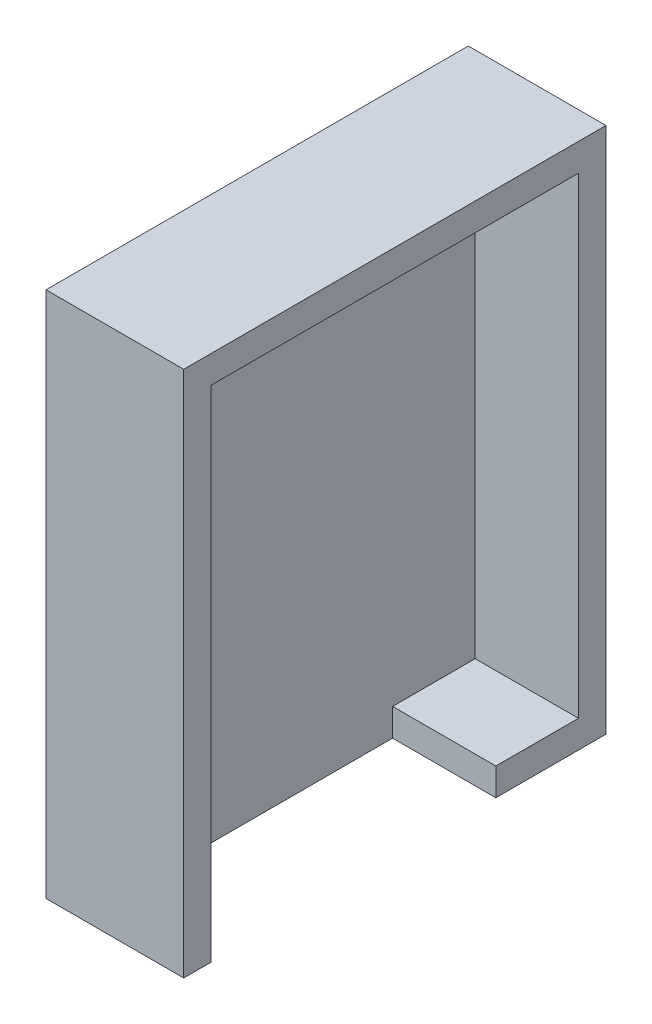
ISO-10303-21;
HEADER;
FILE_DESCRIPTION(('STEP AP214'),'2;1');
FILE_NAME('part.step','',(''),(''),'','','');
FILE_SCHEMA(('AUTOMOTIVE_DESIGN { 1 0 10303 214 1 1 1 1 }'));
ENDSEC;
DATA;
#1=APPLICATION_CONTEXT('core data for automotive mechanical design processes');
#2=APPLICATION_PROTOCOL_DEFINITION('international standard','automotive_design',2000,#1);
#3=PRODUCT_CONTEXT('',#1,'mechanical');
#4=PRODUCT('Part','Part','',(#3));
#5=PRODUCT_RELATED_PRODUCT_CATEGORY('part','',(#4));
#6=PRODUCT_DEFINITION_FORMATION('','',#4);
#7=PRODUCT_DEFINITION_CONTEXT('part definition',#1,'design');
#8=PRODUCT_DEFINITION('design','',#6,#7);
#9=PRODUCT_DEFINITION_SHAPE('','',#8);
#10=(LENGTH_UNIT() NAMED_UNIT(*) SI_UNIT(.MILLI.,.METRE.));
#11=(NAMED_UNIT(*) PLANE_ANGLE_UNIT() SI_UNIT($,.RADIAN.));
#12=(NAMED_UNIT(*) SI_UNIT($,.STERADIAN.) SOLID_ANGLE_UNIT());
#13=UNCERTAINTY_MEASURE_WITH_UNIT(LENGTH_MEASURE(1.E-05),#10,'distance_accuracy_value','');
#14=(GEOMETRIC_REPRESENTATION_CONTEXT(3) GLOBAL_UNCERTAINTY_ASSIGNED_CONTEXT((#13)) GLOBAL_UNIT_ASSIGNED_CONTEXT((#10,
#11,#12)) REPRESENTATION_CONTEXT('',''));
#15=CARTESIAN_POINT('',(0.,0.,0.));
#16=DIRECTION('',(0.,0.,1.));
#17=DIRECTION('',(1.,0.,0.));
#18=AXIS2_PLACEMENT_3D('',#15,#16,#17);
#19=CARTESIAN_POINT('',(15.,0.,-53.34));
#20=DIRECTION('',(0.,0.,1.));
#21=DIRECTION('',(0.,-1.,0.));
#22=AXIS2_PLACEMENT_3D('',#19,#20,#21);
#23=PLANE('',#22);
#24=DIRECTION('',(0.,1.,0.));
#25=VECTOR('',#24,1.);
#26=CARTESIAN_POINT('',(0.,0.,-53.34));
#27=LINE('',#26,#25);
#28=CARTESIAN_POINT('',(0.,-68.58,-53.34));
#29=VERTEX_POINT('',#28);
#30=CARTESIAN_POINT('',(0.,0.,-53.34));
#31=VERTEX_POINT('',#30);
#32=EDGE_CURVE('E164',#29,#31,#27,.T.);
#33=ORIENTED_EDGE('',*,*,#32,.F.);
#34=DIRECTION('',(-1.,0.,0.));
#35=VECTOR('',#34,1.);
#36=CARTESIAN_POINT('',(27.6491106406735,-68.58,-53.34));
#37=LINE('',#36,#35);
#38=CARTESIAN_POINT('',(15.,-68.58,-53.34));
#39=VERTEX_POINT('',#38);
#40=EDGE_CURVE('E48',#39,#29,#37,.T.);
#41=ORIENTED_EDGE('',*,*,#40,.F.);
#42=DIRECTION('',(0.,1.,0.));
#43=VECTOR('',#42,1.);
#44=CARTESIAN_POINT('',(15.,0.,-53.34));
#45=LINE('',#44,#43);
#46=CARTESIAN_POINT('',(15.,0.,-53.34));
#47=VERTEX_POINT('',#46);
#48=EDGE_CURVE('E157',#39,#47,#45,.T.);
#49=ORIENTED_EDGE('',*,*,#48,.T.);
#50=DIRECTION('',(-1.,0.,0.));
#51=VECTOR('',#50,1.);
#52=CARTESIAN_POINT('',(15.,0.,-53.34));
#53=LINE('',#52,#51);
#54=EDGE_CURVE('E169',#47,#31,#53,.T.);
#55=ORIENTED_EDGE('',*,*,#54,.T.);
#56=EDGE_LOOP('',(#33,#41,#49,#55));
#57=FACE_BOUND('',#56,.T.);
#58=ADVANCED_FACE('F33',(#57),#23,.T.);
#59=CARTESIAN_POINT('',(0.,0.,0.));
#60=DIRECTION('',(-1.,0.,0.));
#61=DIRECTION('',(0.,0.,1.));
#62=AXIS2_PLACEMENT_3D('',#59,#60,#61);
#63=PLANE('',#62);
#64=DIRECTION('',(0.,0.,1.));
#65=VECTOR('',#64,1.);
#66=CARTESIAN_POINT('',(0.,-68.58,-41.34));
#67=LINE('',#66,#65);
#68=CARTESIAN_POINT('',(0.,-68.58,-41.34));
#69=VERTEX_POINT('',#68);
#70=EDGE_CURVE('E133',#29,#69,#67,.T.);
#71=ORIENTED_EDGE('',*,*,#70,.F.);
#72=ORIENTED_EDGE('',*,*,#32,.T.);
#73=DIRECTION('',(0.,0.,1.));
#74=VECTOR('',#73,1.);
#75=CARTESIAN_POINT('',(0.,0.,0.));
#76=LINE('',#75,#74);
#77=CARTESIAN_POINT('',(0.,0.,0.));
#78=VERTEX_POINT('',#77);
#79=EDGE_CURVE('E158',#31,#78,#76,.T.);
#80=ORIENTED_EDGE('',*,*,#79,.T.);
#81=DIRECTION('',(0.,-1.,0.));
#82=VECTOR('',#81,1.);
#83=CARTESIAN_POINT('',(0.,0.,0.));
#84=LINE('',#83,#82);
#85=CARTESIAN_POINT('',(0.,-72.58,0.));
#86=VERTEX_POINT('',#85);
#87=EDGE_CURVE('E112',#78,#86,#84,.T.);
#88=ORIENTED_EDGE('',*,*,#87,.T.);
#89=DIRECTION('',(0.,0.,-1.));
#90=VECTOR('',#89,1.);
#91=CARTESIAN_POINT('',(0.,-72.58,0.));
#92=LINE('',#91,#90);
#93=CARTESIAN_POINT('',(0.,-72.58,-41.34));
#94=VERTEX_POINT('',#93);
#95=EDGE_CURVE('E108',#86,#94,#92,.T.);
#96=ORIENTED_EDGE('',*,*,#95,.T.);
#97=DIRECTION('',(0.,-1.,0.));
#98=VECTOR('',#97,1.);
#99=CARTESIAN_POINT('',(0.,-72.58,-41.34));
#100=LINE('',#99,#98);
#101=EDGE_CURVE('E56',#69,#94,#100,.T.);
#102=ORIENTED_EDGE('',*,*,#101,.F.);
#103=EDGE_LOOP('',(#71,#72,#80,#88,#96,#102));
#104=FACE_BOUND('',#103,.T.);
#105=ADVANCED_FACE('F110',(#104),#63,.F.);
#106=CARTESIAN_POINT('',(15.,0.,0.));
#107=DIRECTION('',(-1.,0.,0.));
#108=DIRECTION('',(0.,0.,1.));
#109=AXIS2_PLACEMENT_3D('',#106,#107,#108);
#110=PLANE('',#109);
#111=ORIENTED_EDGE('',*,*,#48,.F.);
#112=DIRECTION('',(0.,0.,-1.));
#113=VECTOR('',#112,1.);
#114=CARTESIAN_POINT('',(15.,-68.58,-41.34));
#115=LINE('',#114,#113);
#116=CARTESIAN_POINT('',(15.,-68.58,-41.34));
#117=VERTEX_POINT('',#116);
#118=EDGE_CURVE('E127',#117,#39,#115,.T.);
#119=ORIENTED_EDGE('',*,*,#118,.F.);
#120=DIRECTION('',(0.,1.,0.));
#121=VECTOR('',#120,1.);
#122=CARTESIAN_POINT('',(15.,-72.58,-41.34));
#123=LINE('',#122,#121);
#124=CARTESIAN_POINT('',(15.,-72.58,-41.34));
#125=VERTEX_POINT('',#124);
#126=EDGE_CURVE('E137',#125,#117,#123,.T.);
#127=ORIENTED_EDGE('',*,*,#126,.F.);
#128=DIRECTION('',(0.,0.,-1.));
#129=VECTOR('',#128,1.);
#130=CARTESIAN_POINT('',(15.,-72.58,4.));
#131=LINE('',#130,#129);
#132=CARTESIAN_POINT('',(15.,-72.58,-57.34));
#133=VERTEX_POINT('',#132);
#134=EDGE_CURVE('E123',#125,#133,#131,.T.);
#135=ORIENTED_EDGE('',*,*,#134,.T.);
#136=DIRECTION('',(0.,1.,0.));
#137=VECTOR('',#136,1.);
#138=CARTESIAN_POINT('',(15.,4.,-57.34));
#139=LINE('',#138,#137);
#140=CARTESIAN_POINT('',(15.,4.,-57.34));
#141=VERTEX_POINT('',#140);
#142=EDGE_CURVE('E180',#133,#141,#139,.T.);
#143=ORIENTED_EDGE('',*,*,#142,.T.);
#144=DIRECTION('',(0.,0.,1.));
#145=VECTOR('',#144,1.);
#146=CARTESIAN_POINT('',(15.,4.,4.));
#147=LINE('',#146,#145);
#148=CARTESIAN_POINT('',(15.,4.,4.));
#149=VERTEX_POINT('',#148);
#150=EDGE_CURVE('E172',#141,#149,#147,.T.);
#151=ORIENTED_EDGE('',*,*,#150,.T.);
#152=DIRECTION('',(0.,-1.,0.));
#153=VECTOR('',#152,1.);
#154=CARTESIAN_POINT('',(15.,4.,4.));
#155=LINE('',#154,#153);
#156=CARTESIAN_POINT('',(15.,-72.58,4.));
#157=VERTEX_POINT('',#156);
#158=EDGE_CURVE('E175',#149,#157,#155,.T.);
#159=ORIENTED_EDGE('',*,*,#158,.T.);
#160=CARTESIAN_POINT('',(15.,-72.58,0.));
#161=VERTEX_POINT('',#160);
#162=EDGE_CURVE('E177',#157,#161,#131,.T.);
#163=ORIENTED_EDGE('',*,*,#162,.T.);
#164=DIRECTION('',(0.,-1.,0.));
#165=VECTOR('',#164,1.);
#166=CARTESIAN_POINT('',(15.,0.,0.));
#167=LINE('',#166,#165);
#168=CARTESIAN_POINT('',(15.,0.,0.));
#169=VERTEX_POINT('',#168);
#170=EDGE_CURVE('E155',#169,#161,#167,.T.);
#171=ORIENTED_EDGE('',*,*,#170,.F.);
#172=DIRECTION('',(0.,0.,1.));
#173=VECTOR('',#172,1.);
#174=CARTESIAN_POINT('',(15.,0.,0.));
#175=LINE('',#174,#173);
#176=EDGE_CURVE('E160',#47,#169,#175,.T.);
#177=ORIENTED_EDGE('',*,*,#176,.F.);
#178=EDGE_LOOP('',(#111,#119,#127,#135,#143,#151,#159,#163,#171,#177));
#179=FACE_BOUND('',#178,.T.);
#180=ADVANCED_FACE('F203',(#179),#110,.F.);
#181=CARTESIAN_POINT('',(15.,4.,4.));
#182=DIRECTION('',(0.,-1.,0.));
#183=DIRECTION('',(0.,0.,-1.));
#184=AXIS2_PLACEMENT_3D('',#181,#182,#183);
#185=PLANE('',#184);
#186=DIRECTION('',(-1.,0.,0.));
#187=VECTOR('',#186,1.);
#188=CARTESIAN_POINT('',(15.,4.,-57.34));
#189=LINE('',#188,#187);
#190=CARTESIAN_POINT('',(-5.,4.,-57.34));
#191=VERTEX_POINT('',#190);
#192=EDGE_CURVE('E182',#141,#191,#189,.T.);
#193=ORIENTED_EDGE('',*,*,#192,.T.);
#194=DIRECTION('',(0.,0.,-1.));
#195=VECTOR('',#194,1.);
#196=CARTESIAN_POINT('',(-5.,4.,-57.34));
#197=LINE('',#196,#195);
#198=CARTESIAN_POINT('',(-5.,4.,4.));
#199=VERTEX_POINT('',#198);
#200=EDGE_CURVE('E152',#199,#191,#197,.T.);
#201=ORIENTED_EDGE('',*,*,#200,.F.);
#202=DIRECTION('',(-1.,0.,0.));
#203=VECTOR('',#202,1.);
#204=CARTESIAN_POINT('',(15.,4.,4.));
#205=LINE('',#204,#203);
#206=EDGE_CURVE('E11',#149,#199,#205,.T.);
#207=ORIENTED_EDGE('',*,*,#206,.F.);
#208=ORIENTED_EDGE('',*,*,#150,.F.);
#209=EDGE_LOOP('',(#193,#201,#207,#208));
#210=FACE_BOUND('',#209,.T.);
#211=ADVANCED_FACE('F35',(#210),#185,.F.);
#212=CARTESIAN_POINT('',(15.,4.,4.));
#213=DIRECTION('',(0.,0.,-1.));
#214=DIRECTION('',(-1.,0.,0.));
#215=AXIS2_PLACEMENT_3D('',#212,#213,#214);
#216=PLANE('',#215);
#217=ORIENTED_EDGE('',*,*,#206,.T.);
#218=DIRECTION('',(0.,1.,0.));
#219=VECTOR('',#218,1.);
#220=CARTESIAN_POINT('',(-5.,4.,4.));
#221=LINE('',#220,#219);
#222=CARTESIAN_POINT('',(-5.,-72.58,4.));
#223=VERTEX_POINT('',#222);
#224=EDGE_CURVE('E149',#223,#199,#221,.T.);
#225=ORIENTED_EDGE('',*,*,#224,.F.);
#226=DIRECTION('',(-1.,0.,0.));
#227=VECTOR('',#226,1.);
#228=CARTESIAN_POINT('',(15.,-72.58,4.));
#229=LINE('',#228,#227);
#230=EDGE_CURVE('E41',#157,#223,#229,.T.);
#231=ORIENTED_EDGE('',*,*,#230,.F.);
#232=ORIENTED_EDGE('',*,*,#158,.F.);
#233=EDGE_LOOP('',(#217,#225,#231,#232));
#234=FACE_BOUND('',#233,.T.);
#235=ADVANCED_FACE('F194',(#234),#216,.F.);
#236=CARTESIAN_POINT('',(15.,-72.58,4.));
#237=DIRECTION('',(0.,1.,0.));
#238=DIRECTION('',(0.,0.,1.));
#239=AXIS2_PLACEMENT_3D('',#236,#237,#238);
#240=PLANE('',#239);
#241=ORIENTED_EDGE('',*,*,#134,.F.);
#242=DIRECTION('',(-1.,0.,0.));
#243=VECTOR('',#242,1.);
#244=CARTESIAN_POINT('',(27.6491106406735,-72.58,-41.34));
#245=LINE('',#244,#243);
#246=EDGE_CURVE('E120',#125,#94,#245,.T.);
#247=ORIENTED_EDGE('',*,*,#246,.T.);
#248=ORIENTED_EDGE('',*,*,#95,.F.);
#249=DIRECTION('',(-1.,0.,0.));
#250=VECTOR('',#249,1.);
#251=CARTESIAN_POINT('',(19.05,-72.58,0.));
#252=LINE('',#251,#250);
#253=EDGE_CURVE('E117',#161,#86,#252,.T.);
#254=ORIENTED_EDGE('',*,*,#253,.F.);
#255=ORIENTED_EDGE('',*,*,#162,.F.);
#256=ORIENTED_EDGE('',*,*,#230,.T.);
#257=DIRECTION('',(0.,0.,1.));
#258=VECTOR('',#257,1.);
#259=CARTESIAN_POINT('',(-5.,-72.58,-57.34));
#260=LINE('',#259,#258);
#261=CARTESIAN_POINT('',(-5.,-72.58,-57.34));
#262=VERTEX_POINT('',#261);
#263=EDGE_CURVE('E146',#262,#223,#260,.T.);
#264=ORIENTED_EDGE('',*,*,#263,.F.);
#265=DIRECTION('',(-1.,0.,0.));
#266=VECTOR('',#265,1.);
#267=CARTESIAN_POINT('',(15.,-72.58,-57.34));
#268=LINE('',#267,#266);
#269=EDGE_CURVE('E184',#133,#262,#268,.T.);
#270=ORIENTED_EDGE('',*,*,#269,.F.);
#271=EDGE_LOOP('',(#241,#247,#248,#254,#255,#256,#264,#270));
#272=FACE_BOUND('',#271,.T.);
#273=ADVANCED_FACE('F121',(#272),#240,.F.);
#274=CARTESIAN_POINT('',(15.,4.,-57.34));
#275=DIRECTION('',(0.,0.,1.));
#276=DIRECTION('',(0.,-1.,0.));
#277=AXIS2_PLACEMENT_3D('',#274,#275,#276);
#278=PLANE('',#277);
#279=ORIENTED_EDGE('',*,*,#269,.T.);
#280=DIRECTION('',(0.,-1.,0.));
#281=VECTOR('',#280,1.);
#282=CARTESIAN_POINT('',(-5.,4.,-57.34));
#283=LINE('',#282,#281);
#284=EDGE_CURVE('E116',#191,#262,#283,.T.);
#285=ORIENTED_EDGE('',*,*,#284,.F.);
#286=ORIENTED_EDGE('',*,*,#192,.F.);
#287=ORIENTED_EDGE('',*,*,#142,.F.);
#288=EDGE_LOOP('',(#279,#285,#286,#287));
#289=FACE_BOUND('',#288,.T.);
#290=ADVANCED_FACE('F200',(#289),#278,.F.);
#291=CARTESIAN_POINT('',(15.,0.,0.));
#292=DIRECTION('',(0.,0.,-1.));
#293=DIRECTION('',(0.,1.,0.));
#294=AXIS2_PLACEMENT_3D('',#291,#292,#293);
#295=PLANE('',#294);
#296=ORIENTED_EDGE('',*,*,#170,.T.);
#297=ORIENTED_EDGE('',*,*,#253,.T.);
#298=ORIENTED_EDGE('',*,*,#87,.F.);
#299=DIRECTION('',(-1.,0.,0.));
#300=VECTOR('',#299,1.);
#301=CARTESIAN_POINT('',(15.,0.,0.));
#302=LINE('',#301,#300);
#303=EDGE_CURVE('E162',#169,#78,#302,.T.);
#304=ORIENTED_EDGE('',*,*,#303,.F.);
#305=EDGE_LOOP('',(#296,#297,#298,#304));
#306=FACE_BOUND('',#305,.T.);
#307=ADVANCED_FACE('F214',(#306),#295,.T.);
#308=CARTESIAN_POINT('',(15.,0.,0.));
#309=DIRECTION('',(0.,-1.,0.));
#310=DIRECTION('',(0.,0.,-1.));
#311=AXIS2_PLACEMENT_3D('',#308,#309,#310);
#312=PLANE('',#311);
#313=ORIENTED_EDGE('',*,*,#79,.F.);
#314=ORIENTED_EDGE('',*,*,#54,.F.);
#315=ORIENTED_EDGE('',*,*,#176,.T.);
#316=ORIENTED_EDGE('',*,*,#303,.T.);
#317=EDGE_LOOP('',(#313,#314,#315,#316));
#318=FACE_BOUND('',#317,.T.);
#319=ADVANCED_FACE('F210',(#318),#312,.T.);
#320=CARTESIAN_POINT('',(-5.,0.,0.));
#321=DIRECTION('',(-1.,0.,0.));
#322=DIRECTION('',(0.,0.,1.));
#323=AXIS2_PLACEMENT_3D('',#320,#321,#322);
#324=PLANE('',#323);
#325=ORIENTED_EDGE('',*,*,#284,.T.);
#326=ORIENTED_EDGE('',*,*,#263,.T.);
#327=ORIENTED_EDGE('',*,*,#224,.T.);
#328=ORIENTED_EDGE('',*,*,#200,.T.);
#329=EDGE_LOOP('',(#325,#326,#327,#328));
#330=FACE_BOUND('',#329,.T.);
#331=ADVANCED_FACE('F191',(#330),#324,.T.);
#332=CARTESIAN_POINT('',(27.6491106406735,-68.58,-41.34));
#333=DIRECTION('',(0.,-1.,0.));
#334=DIRECTION('',(0.,0.,-1.));
#335=AXIS2_PLACEMENT_3D('',#332,#333,#334);
#336=PLANE('',#335);
#337=DIRECTION('',(-1.,0.,0.));
#338=VECTOR('',#337,1.);
#339=CARTESIAN_POINT('',(27.6491106406735,-68.58,-41.34));
#340=LINE('',#339,#338);
#341=EDGE_CURVE('E131',#117,#69,#340,.T.);
#342=ORIENTED_EDGE('',*,*,#341,.F.);
#343=ORIENTED_EDGE('',*,*,#118,.T.);
#344=ORIENTED_EDGE('',*,*,#40,.T.);
#345=ORIENTED_EDGE('',*,*,#70,.T.);
#346=EDGE_LOOP('',(#342,#343,#344,#345));
#347=FACE_BOUND('',#346,.T.);
#348=ADVANCED_FACE('F205',(#347),#336,.F.);
#349=CARTESIAN_POINT('',(27.6491106406735,-72.58,-41.34));
#350=DIRECTION('',(0.,0.,-1.));
#351=DIRECTION('',(-1.,0.,0.));
#352=AXIS2_PLACEMENT_3D('',#349,#350,#351);
#353=PLANE('',#352);
#354=ORIENTED_EDGE('',*,*,#246,.F.);
#355=ORIENTED_EDGE('',*,*,#126,.T.);
#356=ORIENTED_EDGE('',*,*,#341,.T.);
#357=ORIENTED_EDGE('',*,*,#101,.T.);
#358=EDGE_LOOP('',(#354,#355,#356,#357));
#359=FACE_BOUND('',#358,.T.);
#360=ADVANCED_FACE('F129',(#359),#353,.F.);
#361=CLOSED_SHELL('',(#58,#105,#180,#211,#235,#273,#290,#307,#319,#331,#348,#360));
#362=MANIFOLD_SOLID_BREP('B2',#361);
#363=ADVANCED_BREP_SHAPE_REPRESENTATION('',(#18,#362),#14);
#364=SHAPE_DEFINITION_REPRESENTATION(#9,#363);
ENDSEC;
END-ISO-10303-21;
